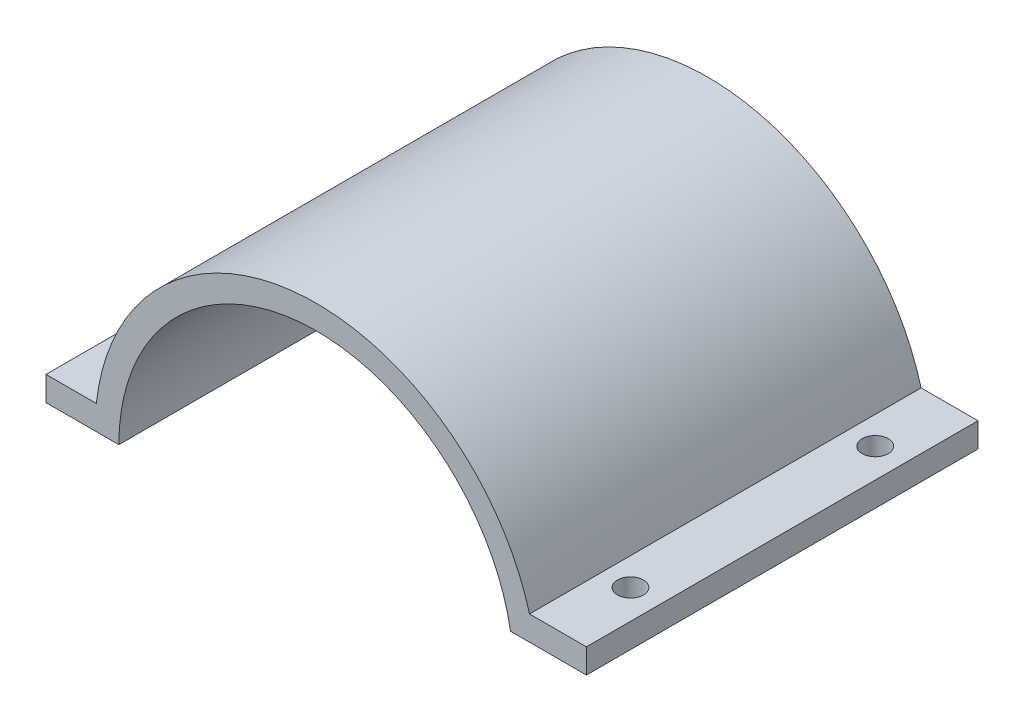
ISO-10303-21;
HEADER;
FILE_DESCRIPTION(('STEP AP214'),'2;1');
FILE_NAME('part.step','',(''),(''),'','','');
FILE_SCHEMA(('AUTOMOTIVE_DESIGN { 1 0 10303 214 1 1 1 1 }'));
ENDSEC;
DATA;
#1=APPLICATION_CONTEXT('core data for automotive mechanical design processes');
#2=APPLICATION_PROTOCOL_DEFINITION('international standard','automotive_design',2000,#1);
#3=PRODUCT_CONTEXT('',#1,'mechanical');
#4=PRODUCT('Part','Part','',(#3));
#5=PRODUCT_RELATED_PRODUCT_CATEGORY('part','',(#4));
#6=PRODUCT_DEFINITION_FORMATION('','',#4);
#7=PRODUCT_DEFINITION_CONTEXT('part definition',#1,'design');
#8=PRODUCT_DEFINITION('design','',#6,#7);
#9=PRODUCT_DEFINITION_SHAPE('','',#8);
#10=(LENGTH_UNIT() NAMED_UNIT(*) SI_UNIT(.MILLI.,.METRE.));
#11=(NAMED_UNIT(*) PLANE_ANGLE_UNIT() SI_UNIT($,.RADIAN.));
#12=(NAMED_UNIT(*) SI_UNIT($,.STERADIAN.) SOLID_ANGLE_UNIT());
#13=UNCERTAINTY_MEASURE_WITH_UNIT(LENGTH_MEASURE(1.E-05),#10,'distance_accuracy_value','');
#14=(GEOMETRIC_REPRESENTATION_CONTEXT(3) GLOBAL_UNCERTAINTY_ASSIGNED_CONTEXT((#13)) GLOBAL_UNIT_ASSIGNED_CONTEXT((#10,
#11,#12)) REPRESENTATION_CONTEXT('',''));
#15=CARTESIAN_POINT('',(0.,0.,0.));
#16=DIRECTION('',(0.,0.,1.));
#17=DIRECTION('',(1.,0.,0.));
#18=AXIS2_PLACEMENT_3D('',#15,#16,#17);
#19=CARTESIAN_POINT('',(0.,0.,50.8));
#20=DIRECTION('',(0.,-1.,0.));
#21=DIRECTION('',(1.,0.,0.));
#22=AXIS2_PLACEMENT_3D('',#19,#20,#21);
#23=PLANE('',#22);
#24=CARTESIAN_POINT('',(-62.484,0.,-31.75));
#25=DIRECTION('',(0.,1.,0.));
#26=DIRECTION('',(0.,0.,1.));
#27=AXIS2_PLACEMENT_3D('',#24,#25,#26);
#28=CIRCLE('',#27,3.3782);
#29=CARTESIAN_POINT('',(-62.484,0.,-28.3718));
#30=VERTEX_POINT('',#29);
#31=EDGE_CURVE('E226',#30,#30,#28,.T.);
#32=ORIENTED_EDGE('',*,*,#31,.T.);
#33=EDGE_LOOP('',(#32));
#34=FACE_BOUND('',#33,.T.);
#35=DIRECTION('',(-1.,0.,0.));
#36=VECTOR('',#35,1.);
#37=CARTESIAN_POINT('',(0.,0.,-50.8));
#38=LINE('',#37,#36);
#39=CARTESIAN_POINT('',(-51.203999954,0.,-50.8));
#40=VERTEX_POINT('',#39);
#41=CARTESIAN_POINT('',(-70.104,0.,-50.8));
#42=VERTEX_POINT('',#41);
#43=EDGE_CURVE('E168',#40,#42,#38,.T.);
#44=ORIENTED_EDGE('',*,*,#43,.F.);
#45=DIRECTION('',(0.,0.,-1.));
#46=VECTOR('',#45,1.);
#47=CARTESIAN_POINT('',(-51.203999954,0.,50.8));
#48=LINE('',#47,#46);
#49=CARTESIAN_POINT('',(-51.203999954,0.,50.8));
#50=VERTEX_POINT('',#49);
#51=EDGE_CURVE('E65',#50,#40,#48,.T.);
#52=ORIENTED_EDGE('',*,*,#51,.F.);
#53=DIRECTION('',(-1.,0.,0.));
#54=VECTOR('',#53,1.);
#55=CARTESIAN_POINT('',(0.,0.,50.8));
#56=LINE('',#55,#54);
#57=CARTESIAN_POINT('',(-70.104,0.,50.8));
#58=VERTEX_POINT('',#57);
#59=EDGE_CURVE('E140',#50,#58,#56,.T.);
#60=ORIENTED_EDGE('',*,*,#59,.T.);
#61=DIRECTION('',(0.,0.,-1.));
#62=VECTOR('',#61,1.);
#63=CARTESIAN_POINT('',(-70.104,0.,50.8));
#64=LINE('',#63,#62);
#65=EDGE_CURVE('E90',#58,#42,#64,.T.);
#66=ORIENTED_EDGE('',*,*,#65,.T.);
#67=EDGE_LOOP('',(#44,#52,#60,#66));
#68=FACE_BOUND('',#67,.T.);
#69=CARTESIAN_POINT('',(-62.484,0.,31.75));
#70=DIRECTION('',(0.,1.,0.));
#71=DIRECTION('',(0.,0.,1.));
#72=AXIS2_PLACEMENT_3D('',#69,#70,#71);
#73=CIRCLE('',#72,3.3782);
#74=CARTESIAN_POINT('',(-62.484,0.,35.1282));
#75=VERTEX_POINT('',#74);
#76=EDGE_CURVE('E150',#75,#75,#73,.T.);
#77=ORIENTED_EDGE('',*,*,#76,.T.);
#78=EDGE_LOOP('',(#77));
#79=FACE_BOUND('',#78,.T.);
#80=ADVANCED_FACE('F47',(#34,#68,#79),#23,.T.);
#81=CARTESIAN_POINT('',(0.,0.,50.8));
#82=DIRECTION('',(0.,0.,-1.));
#83=DIRECTION('',(-1.,0.,0.));
#84=AXIS2_PLACEMENT_3D('',#81,#82,#83);
#85=CYLINDRICAL_SURFACE('',#84,51.203999954);
#86=CARTESIAN_POINT('',(0.,0.,-50.8));
#87=DIRECTION('',(0.,0.,1.));
#88=DIRECTION('',(1.,0.,0.));
#89=AXIS2_PLACEMENT_3D('',#86,#87,#88);
#90=CIRCLE('',#89,51.203999954);
#91=CARTESIAN_POINT('',(50.426096139936,8.8914812812697,-50.8));
#92=VERTEX_POINT('',#91);
#93=EDGE_CURVE('E146',#92,#40,#90,.T.);
#94=ORIENTED_EDGE('',*,*,#93,.F.);
#95=DIRECTION('',(0.,0.,-1.));
#96=VECTOR('',#95,1.);
#97=CARTESIAN_POINT('',(50.426096139936,8.8914812812697,50.8));
#98=LINE('',#97,#96);
#99=CARTESIAN_POINT('',(50.426096139936,8.8914812812697,50.8));
#100=VERTEX_POINT('',#99);
#101=EDGE_CURVE('E11',#100,#92,#98,.T.);
#102=ORIENTED_EDGE('',*,*,#101,.F.);
#103=CARTESIAN_POINT('',(0.,0.,50.8));
#104=DIRECTION('',(0.,0.,1.));
#105=DIRECTION('',(1.,0.,0.));
#106=AXIS2_PLACEMENT_3D('',#103,#104,#105);
#107=CIRCLE('',#106,51.203999954);
#108=EDGE_CURVE('E172',#100,#50,#107,.T.);
#109=ORIENTED_EDGE('',*,*,#108,.T.);
#110=ORIENTED_EDGE('',*,*,#51,.T.);
#111=EDGE_LOOP('',(#94,#102,#109,#110));
#112=FACE_BOUND('',#111,.T.);
#113=ADVANCED_FACE('F49',(#112),#85,.F.);
#114=CARTESIAN_POINT('',(0.,8.8914812812697,50.8));
#115=DIRECTION('',(0.,1.,0.));
#116=DIRECTION('',(0.,0.,1.));
#117=AXIS2_PLACEMENT_3D('',#114,#115,#116);
#118=PLANE('',#117);
#119=CARTESIAN_POINT('',(62.484,8.8914812812697,-31.75));
#120=DIRECTION('',(0.,1.,0.));
#121=DIRECTION('',(0.,0.,1.));
#122=AXIS2_PLACEMENT_3D('',#119,#120,#121);
#123=CIRCLE('',#122,3.3782);
#124=CARTESIAN_POINT('',(62.484,8.8914812812697,-28.3718));
#125=VERTEX_POINT('',#124);
#126=EDGE_CURVE('E242',#125,#125,#123,.T.);
#127=ORIENTED_EDGE('',*,*,#126,.T.);
#128=EDGE_LOOP('',(#127));
#129=FACE_BOUND('',#128,.T.);
#130=CARTESIAN_POINT('',(62.484,8.8914812812697,31.75));
#131=DIRECTION('',(0.,1.,0.));
#132=DIRECTION('',(0.,0.,1.));
#133=AXIS2_PLACEMENT_3D('',#130,#131,#132);
#134=CIRCLE('',#133,3.3782);
#135=CARTESIAN_POINT('',(62.484,8.8914812812697,35.1282));
#136=VERTEX_POINT('',#135);
#137=EDGE_CURVE('E234',#136,#136,#134,.T.);
#138=ORIENTED_EDGE('',*,*,#137,.T.);
#139=EDGE_LOOP('',(#138));
#140=FACE_BOUND('',#139,.T.);
#141=DIRECTION('',(1.,0.,0.));
#142=VECTOR('',#141,1.);
#143=CARTESIAN_POINT('',(0.,8.8914812812697,-50.8));
#144=LINE('',#143,#142);
#145=CARTESIAN_POINT('',(70.104,8.8914812812697,-50.8));
#146=VERTEX_POINT('',#145);
#147=EDGE_CURVE('E149',#92,#146,#144,.T.);
#148=ORIENTED_EDGE('',*,*,#147,.T.);
#149=DIRECTION('',(0.,0.,-1.));
#150=VECTOR('',#149,1.);
#151=CARTESIAN_POINT('',(70.104,8.8914812812697,50.8));
#152=LINE('',#151,#150);
#153=CARTESIAN_POINT('',(70.104,8.8914812812697,50.8));
#154=VERTEX_POINT('',#153);
#155=EDGE_CURVE('E57',#154,#146,#152,.T.);
#156=ORIENTED_EDGE('',*,*,#155,.F.);
#157=DIRECTION('',(1.,0.,0.));
#158=VECTOR('',#157,1.);
#159=CARTESIAN_POINT('',(0.,8.8914812812697,50.8));
#160=LINE('',#159,#158);
#161=EDGE_CURVE('E214',#100,#154,#160,.T.);
#162=ORIENTED_EDGE('',*,*,#161,.F.);
#163=ORIENTED_EDGE('',*,*,#101,.T.);
#164=EDGE_LOOP('',(#148,#156,#162,#163));
#165=FACE_BOUND('',#164,.T.);
#166=ADVANCED_FACE('F266',(#129,#140,#165),#118,.F.);
#167=CARTESIAN_POINT('',(70.104,0.,50.8));
#168=DIRECTION('',(-1.,0.,0.));
#169=DIRECTION('',(0.,0.,1.));
#170=AXIS2_PLACEMENT_3D('',#167,#168,#169);
#171=PLANE('',#170);
#172=DIRECTION('',(0.,1.,0.));
#173=VECTOR('',#172,1.);
#174=CARTESIAN_POINT('',(70.104,0.,-50.8));
#175=LINE('',#174,#173);
#176=CARTESIAN_POINT('',(70.104,15.2414812812697,-50.8));
#177=VERTEX_POINT('',#176);
#178=EDGE_CURVE('E153',#146,#177,#175,.T.);
#179=ORIENTED_EDGE('',*,*,#178,.T.);
#180=DIRECTION('',(0.,0.,-1.));
#181=VECTOR('',#180,1.);
#182=CARTESIAN_POINT('',(70.104,15.2414812812697,50.8));
#183=LINE('',#182,#181);
#184=CARTESIAN_POINT('',(70.104,15.2414812812697,50.8));
#185=VERTEX_POINT('',#184);
#186=EDGE_CURVE('E183',#185,#177,#183,.T.);
#187=ORIENTED_EDGE('',*,*,#186,.F.);
#188=DIRECTION('',(0.,1.,0.));
#189=VECTOR('',#188,1.);
#190=CARTESIAN_POINT('',(70.104,0.,50.8));
#191=LINE('',#190,#189);
#192=EDGE_CURVE('E194',#154,#185,#191,.T.);
#193=ORIENTED_EDGE('',*,*,#192,.F.);
#194=ORIENTED_EDGE('',*,*,#155,.T.);
#195=EDGE_LOOP('',(#179,#187,#193,#194));
#196=FACE_BOUND('',#195,.T.);
#197=ADVANCED_FACE('F192',(#196),#171,.F.);
#198=CARTESIAN_POINT('',(0.,15.2414812812697,50.8));
#199=DIRECTION('',(0.,-1.,0.));
#200=DIRECTION('',(1.,0.,0.));
#201=AXIS2_PLACEMENT_3D('',#198,#199,#200);
#202=PLANE('',#201);
#203=CARTESIAN_POINT('',(62.484,15.2414812812697,-31.75));
#204=DIRECTION('',(0.,1.,0.));
#205=DIRECTION('',(0.,0.,1.));
#206=AXIS2_PLACEMENT_3D('',#203,#204,#205);
#207=CIRCLE('',#206,3.3782);
#208=CARTESIAN_POINT('',(62.484,15.2414812812697,-28.3718));
#209=VERTEX_POINT('',#208);
#210=EDGE_CURVE('E246',#209,#209,#207,.T.);
#211=ORIENTED_EDGE('',*,*,#210,.F.);
#212=EDGE_LOOP('',(#211));
#213=FACE_BOUND('',#212,.T.);
#214=CARTESIAN_POINT('',(62.484,15.2414812812697,31.75));
#215=DIRECTION('',(0.,1.,0.));
#216=DIRECTION('',(0.,0.,1.));
#217=AXIS2_PLACEMENT_3D('',#214,#215,#216);
#218=CIRCLE('',#217,3.3782);
#219=CARTESIAN_POINT('',(62.484,15.2414812812697,35.1282));
#220=VERTEX_POINT('',#219);
#221=EDGE_CURVE('E238',#220,#220,#218,.T.);
#222=ORIENTED_EDGE('',*,*,#221,.F.);
#223=EDGE_LOOP('',(#222));
#224=FACE_BOUND('',#223,.T.);
#225=DIRECTION('',(-1.,0.,0.));
#226=VECTOR('',#225,1.);
#227=CARTESIAN_POINT('',(0.,15.2414812812697,-50.8));
#228=LINE('',#227,#226);
#229=CARTESIAN_POINT('',(55.343621713371,15.2414812812697,-50.8));
#230=VERTEX_POINT('',#229);
#231=EDGE_CURVE('E156',#177,#230,#228,.T.);
#232=ORIENTED_EDGE('',*,*,#231,.T.);
#233=DIRECTION('',(0.,0.,-1.));
#234=VECTOR('',#233,1.);
#235=CARTESIAN_POINT('',(55.343621713371,15.2414812812697,50.8));
#236=LINE('',#235,#234);
#237=CARTESIAN_POINT('',(55.343621713371,15.2414812812697,50.8));
#238=VERTEX_POINT('',#237);
#239=EDGE_CURVE('E179',#238,#230,#236,.T.);
#240=ORIENTED_EDGE('',*,*,#239,.F.);
#241=DIRECTION('',(-1.,0.,0.));
#242=VECTOR('',#241,1.);
#243=CARTESIAN_POINT('',(0.,15.2414812812697,50.8));
#244=LINE('',#243,#242);
#245=EDGE_CURVE('E208',#185,#238,#244,.T.);
#246=ORIENTED_EDGE('',*,*,#245,.F.);
#247=ORIENTED_EDGE('',*,*,#186,.T.);
#248=EDGE_LOOP('',(#232,#240,#246,#247));
#249=FACE_BOUND('',#248,.T.);
#250=ADVANCED_FACE('F203',(#213,#224,#249),#202,.F.);
#251=CARTESIAN_POINT('',(0.,0.,50.8));
#252=DIRECTION('',(0.,0.,-1.));
#253=DIRECTION('',(-1.,0.,0.));
#254=AXIS2_PLACEMENT_3D('',#251,#252,#253);
#255=CYLINDRICAL_SURFACE('',#254,57.404);
#256=CARTESIAN_POINT('',(0.,0.,-50.8));
#257=DIRECTION('',(0.,0.,1.));
#258=DIRECTION('',(1.,0.,0.));
#259=AXIS2_PLACEMENT_3D('',#256,#257,#258);
#260=CIRCLE('',#259,57.404);
#261=CARTESIAN_POINT('',(-57.0517021306113,6.35,-50.8));
#262=VERTEX_POINT('',#261);
#263=EDGE_CURVE('E159',#230,#262,#260,.T.);
#264=ORIENTED_EDGE('',*,*,#263,.T.);
#265=DIRECTION('',(0.,0.,-1.));
#266=VECTOR('',#265,1.);
#267=CARTESIAN_POINT('',(-57.0517021306113,6.35,50.8));
#268=LINE('',#267,#266);
#269=CARTESIAN_POINT('',(-57.0517021306113,6.35,50.8));
#270=VERTEX_POINT('',#269);
#271=EDGE_CURVE('E125',#270,#262,#268,.T.);
#272=ORIENTED_EDGE('',*,*,#271,.F.);
#273=CARTESIAN_POINT('',(0.,0.,50.8));
#274=DIRECTION('',(0.,0.,1.));
#275=DIRECTION('',(1.,0.,0.));
#276=AXIS2_PLACEMENT_3D('',#273,#274,#275);
#277=CIRCLE('',#276,57.404);
#278=EDGE_CURVE('E134',#238,#270,#277,.T.);
#279=ORIENTED_EDGE('',*,*,#278,.F.);
#280=ORIENTED_EDGE('',*,*,#239,.T.);
#281=EDGE_LOOP('',(#264,#272,#279,#280));
#282=FACE_BOUND('',#281,.T.);
#283=ADVANCED_FACE('F206',(#282),#255,.T.);
#284=CARTESIAN_POINT('',(0.,6.35,50.8));
#285=DIRECTION('',(0.,1.,0.));
#286=DIRECTION('',(-1.,0.,0.));
#287=AXIS2_PLACEMENT_3D('',#284,#285,#286);
#288=PLANE('',#287);
#289=CARTESIAN_POINT('',(-62.484,6.35,-31.75));
#290=DIRECTION('',(0.,1.,0.));
#291=DIRECTION('',(0.,0.,1.));
#292=AXIS2_PLACEMENT_3D('',#289,#290,#291);
#293=CIRCLE('',#292,3.3782);
#294=CARTESIAN_POINT('',(-62.484,6.35,-28.3718));
#295=VERTEX_POINT('',#294);
#296=EDGE_CURVE('E230',#295,#295,#293,.T.);
#297=ORIENTED_EDGE('',*,*,#296,.F.);
#298=EDGE_LOOP('',(#297));
#299=FACE_BOUND('',#298,.T.);
#300=CARTESIAN_POINT('',(-62.484,6.35,31.75));
#301=DIRECTION('',(0.,1.,0.));
#302=DIRECTION('',(0.,0.,1.));
#303=AXIS2_PLACEMENT_3D('',#300,#301,#302);
#304=CIRCLE('',#303,3.3782);
#305=CARTESIAN_POINT('',(-62.484,6.35,35.1282));
#306=VERTEX_POINT('',#305);
#307=EDGE_CURVE('E222',#306,#306,#304,.T.);
#308=ORIENTED_EDGE('',*,*,#307,.F.);
#309=EDGE_LOOP('',(#308));
#310=FACE_BOUND('',#309,.T.);
#311=DIRECTION('',(1.,0.,0.));
#312=VECTOR('',#311,1.);
#313=CARTESIAN_POINT('',(0.,6.35,-50.8));
#314=LINE('',#313,#312);
#315=CARTESIAN_POINT('',(-70.104,6.35,-50.8));
#316=VERTEX_POINT('',#315);
#317=EDGE_CURVE('E120',#316,#262,#314,.T.);
#318=ORIENTED_EDGE('',*,*,#317,.F.);
#319=DIRECTION('',(0.,0.,-1.));
#320=VECTOR('',#319,1.);
#321=CARTESIAN_POINT('',(-70.104,6.35,50.8));
#322=LINE('',#321,#320);
#323=CARTESIAN_POINT('',(-70.104,6.35,50.8));
#324=VERTEX_POINT('',#323);
#325=EDGE_CURVE('E115',#324,#316,#322,.T.);
#326=ORIENTED_EDGE('',*,*,#325,.F.);
#327=DIRECTION('',(1.,0.,0.));
#328=VECTOR('',#327,1.);
#329=CARTESIAN_POINT('',(0.,6.35,50.8));
#330=LINE('',#329,#328);
#331=EDGE_CURVE('E118',#324,#270,#330,.T.);
#332=ORIENTED_EDGE('',*,*,#331,.T.);
#333=ORIENTED_EDGE('',*,*,#271,.T.);
#334=EDGE_LOOP('',(#318,#326,#332,#333));
#335=FACE_BOUND('',#334,.T.);
#336=ADVANCED_FACE('F117',(#299,#310,#335),#288,.T.);
#337=CARTESIAN_POINT('',(-70.104,0.,50.8));
#338=DIRECTION('',(-1.,0.,0.));
#339=DIRECTION('',(0.,0.,1.));
#340=AXIS2_PLACEMENT_3D('',#337,#338,#339);
#341=PLANE('',#340);
#342=DIRECTION('',(0.,1.,0.));
#343=VECTOR('',#342,1.);
#344=CARTESIAN_POINT('',(-70.104,0.,-50.8));
#345=LINE('',#344,#343);
#346=EDGE_CURVE('E165',#42,#316,#345,.T.);
#347=ORIENTED_EDGE('',*,*,#346,.F.);
#348=ORIENTED_EDGE('',*,*,#65,.F.);
#349=DIRECTION('',(0.,1.,0.));
#350=VECTOR('',#349,1.);
#351=CARTESIAN_POINT('',(-70.104,0.,50.8));
#352=LINE('',#351,#350);
#353=EDGE_CURVE('E132',#58,#324,#352,.T.);
#354=ORIENTED_EDGE('',*,*,#353,.T.);
#355=ORIENTED_EDGE('',*,*,#325,.T.);
#356=EDGE_LOOP('',(#347,#348,#354,#355));
#357=FACE_BOUND('',#356,.T.);
#358=ADVANCED_FACE('F138',(#357),#341,.T.);
#359=CARTESIAN_POINT('',(0.,0.,50.8));
#360=DIRECTION('',(0.,0.,1.));
#361=DIRECTION('',(1.,0.,0.));
#362=AXIS2_PLACEMENT_3D('',#359,#360,#361);
#363=PLANE('',#362);
#364=ORIENTED_EDGE('',*,*,#108,.F.);
#365=ORIENTED_EDGE('',*,*,#161,.T.);
#366=ORIENTED_EDGE('',*,*,#192,.T.);
#367=ORIENTED_EDGE('',*,*,#245,.T.);
#368=ORIENTED_EDGE('',*,*,#278,.T.);
#369=ORIENTED_EDGE('',*,*,#331,.F.);
#370=ORIENTED_EDGE('',*,*,#353,.F.);
#371=ORIENTED_EDGE('',*,*,#59,.F.);
#372=EDGE_LOOP('',(#364,#365,#366,#367,#368,#369,#370,#371));
#373=FACE_BOUND('',#372,.T.);
#374=ADVANCED_FACE('F130',(#373),#363,.T.);
#375=CARTESIAN_POINT('',(0.,0.,-50.8));
#376=DIRECTION('',(0.,0.,1.));
#377=DIRECTION('',(1.,0.,0.));
#378=AXIS2_PLACEMENT_3D('',#375,#376,#377);
#379=PLANE('',#378);
#380=ORIENTED_EDGE('',*,*,#93,.T.);
#381=ORIENTED_EDGE('',*,*,#43,.T.);
#382=ORIENTED_EDGE('',*,*,#346,.T.);
#383=ORIENTED_EDGE('',*,*,#317,.T.);
#384=ORIENTED_EDGE('',*,*,#263,.F.);
#385=ORIENTED_EDGE('',*,*,#231,.F.);
#386=ORIENTED_EDGE('',*,*,#178,.F.);
#387=ORIENTED_EDGE('',*,*,#147,.F.);
#388=EDGE_LOOP('',(#380,#381,#382,#383,#384,#385,#386,#387));
#389=FACE_BOUND('',#388,.T.);
#390=ADVANCED_FACE('F199',(#389),#379,.F.);
#391=CARTESIAN_POINT('',(-62.484,6.35,31.75));
#392=DIRECTION('',(0.,1.,0.));
#393=DIRECTION('',(0.,0.,1.));
#394=AXIS2_PLACEMENT_3D('',#391,#392,#393);
#395=CYLINDRICAL_SURFACE('',#394,3.3782);
#396=ORIENTED_EDGE('',*,*,#76,.F.);
#397=EDGE_LOOP('',(#396));
#398=FACE_BOUND('',#397,.T.);
#399=ORIENTED_EDGE('',*,*,#307,.T.);
#400=EDGE_LOOP('',(#399));
#401=FACE_BOUND('',#400,.T.);
#402=ADVANCED_FACE('F317',(#398,#401),#395,.F.);
#403=CARTESIAN_POINT('',(-62.484,6.35,-31.75));
#404=DIRECTION('',(0.,1.,0.));
#405=DIRECTION('',(0.,0.,1.));
#406=AXIS2_PLACEMENT_3D('',#403,#404,#405);
#407=CYLINDRICAL_SURFACE('',#406,3.3782);
#408=ORIENTED_EDGE('',*,*,#31,.F.);
#409=EDGE_LOOP('',(#408));
#410=FACE_BOUND('',#409,.T.);
#411=ORIENTED_EDGE('',*,*,#296,.T.);
#412=EDGE_LOOP('',(#411));
#413=FACE_BOUND('',#412,.T.);
#414=ADVANCED_FACE('F262',(#410,#413),#407,.F.);
#415=CARTESIAN_POINT('',(62.484,15.2414812812697,31.75));
#416=DIRECTION('',(0.,1.,0.));
#417=DIRECTION('',(0.,0.,1.));
#418=AXIS2_PLACEMENT_3D('',#415,#416,#417);
#419=CYLINDRICAL_SURFACE('',#418,3.3782);
#420=ORIENTED_EDGE('',*,*,#221,.T.);
#421=EDGE_LOOP('',(#420));
#422=FACE_BOUND('',#421,.T.);
#423=ORIENTED_EDGE('',*,*,#137,.F.);
#424=EDGE_LOOP('',(#423));
#425=FACE_BOUND('',#424,.T.);
#426=ADVANCED_FACE('F259',(#422,#425),#419,.F.);
#427=CARTESIAN_POINT('',(62.484,15.2414812812697,-31.75));
#428=DIRECTION('',(0.,1.,0.));
#429=DIRECTION('',(0.,0.,1.));
#430=AXIS2_PLACEMENT_3D('',#427,#428,#429);
#431=CYLINDRICAL_SURFACE('',#430,3.3782);
#432=ORIENTED_EDGE('',*,*,#210,.T.);
#433=EDGE_LOOP('',(#432));
#434=FACE_BOUND('',#433,.T.);
#435=ORIENTED_EDGE('',*,*,#126,.F.);
#436=EDGE_LOOP('',(#435));
#437=FACE_BOUND('',#436,.T.);
#438=ADVANCED_FACE('F251',(#434,#437),#431,.F.);
#439=CLOSED_SHELL('',(#80,#113,#166,#197,#250,#283,#336,#358,#374,#390,#402,#414,#426,#438));
#440=MANIFOLD_SOLID_BREP('B2',#439);
#441=ADVANCED_BREP_SHAPE_REPRESENTATION('',(#18,#440),#14);
#442=SHAPE_DEFINITION_REPRESENTATION(#9,#441);
ENDSEC;
END-ISO-10303-21;
